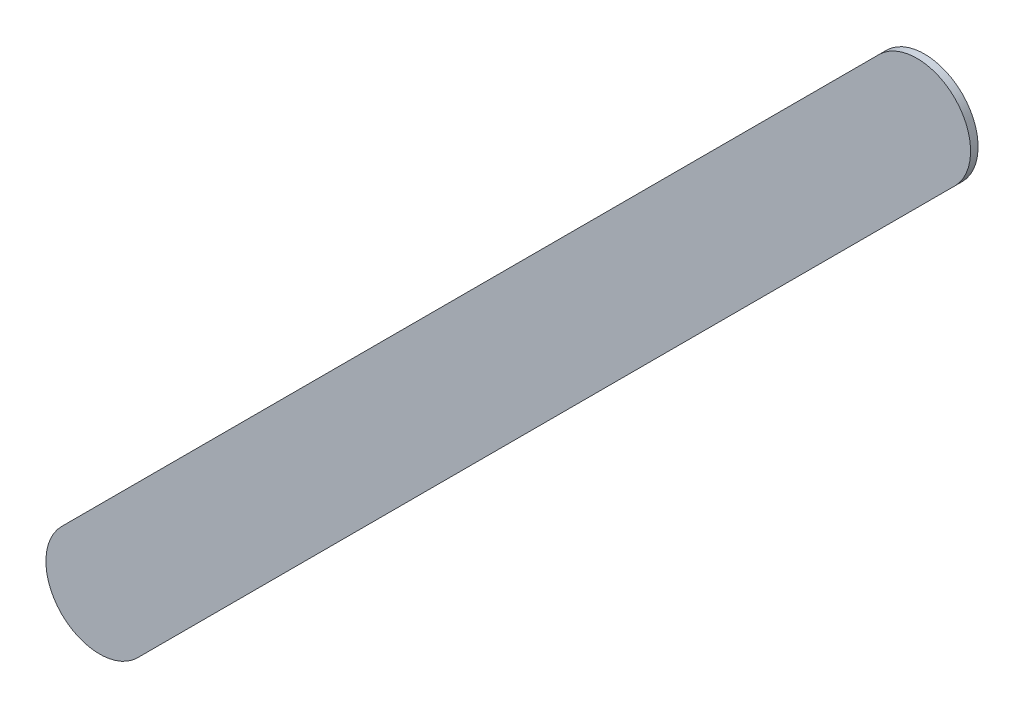
ISO-10303-21;
HEADER;
FILE_DESCRIPTION(('STEP AP214'),'2;1');
FILE_NAME('part.step','',(''),(''),'','','');
FILE_SCHEMA(('AUTOMOTIVE_DESIGN { 1 0 10303 214 1 1 1 1 }'));
ENDSEC;
DATA;
#1=APPLICATION_CONTEXT('core data for automotive mechanical design processes');
#2=APPLICATION_PROTOCOL_DEFINITION('international standard','automotive_design',2000,#1);
#3=PRODUCT_CONTEXT('',#1,'mechanical');
#4=PRODUCT('Part','Part','',(#3));
#5=PRODUCT_RELATED_PRODUCT_CATEGORY('part','',(#4));
#6=PRODUCT_DEFINITION_FORMATION('','',#4);
#7=PRODUCT_DEFINITION_CONTEXT('part definition',#1,'design');
#8=PRODUCT_DEFINITION('design','',#6,#7);
#9=PRODUCT_DEFINITION_SHAPE('','',#8);
#10=(LENGTH_UNIT() NAMED_UNIT(*) SI_UNIT(.MILLI.,.METRE.));
#11=(NAMED_UNIT(*) PLANE_ANGLE_UNIT() SI_UNIT($,.RADIAN.));
#12=(NAMED_UNIT(*) SI_UNIT($,.STERADIAN.) SOLID_ANGLE_UNIT());
#13=UNCERTAINTY_MEASURE_WITH_UNIT(LENGTH_MEASURE(1.E-05),#10,'distance_accuracy_value','');
#14=(GEOMETRIC_REPRESENTATION_CONTEXT(3) GLOBAL_UNCERTAINTY_ASSIGNED_CONTEXT((#13)) GLOBAL_UNIT_ASSIGNED_CONTEXT((#10,
#11,#12)) REPRESENTATION_CONTEXT('',''));
#15=CARTESIAN_POINT('',(0.,0.,0.));
#16=DIRECTION('',(0.,0.,1.));
#17=DIRECTION('',(1.,0.,0.));
#18=AXIS2_PLACEMENT_3D('',#15,#16,#17);
#19=CARTESIAN_POINT('',(143.686776,-110.158776,0.));
#20=DIRECTION('',(0.,0.,1.));
#21=DIRECTION('',(1.,0.,0.));
#22=AXIS2_PLACEMENT_3D('',#19,#20,#21);
#23=PLANE('',#22);
#24=DIRECTION('',(0.707106781186548,0.707106781186548,0.));
#25=VECTOR('',#24,1.);
#26=CARTESIAN_POINT('',(143.686776,-110.158776,0.));
#27=LINE('',#26,#25);
#28=CARTESIAN_POINT('',(143.686776,-110.158776,0.));
#29=VERTEX_POINT('',#28);
#30=CARTESIAN_POINT('',(147.496776,-106.348776,0.));
#31=VERTEX_POINT('',#30);
#32=EDGE_CURVE('E95',#29,#31,#27,.T.);
#33=ORIENTED_EDGE('',*,*,#32,.T.);
#34=CARTESIAN_POINT('',(147.3199995,-106.1719995,0.));
#35=DIRECTION('',(0.,0.,1.));
#36=DIRECTION('',(0.707106781186548,-0.707106781186548,0.));
#37=AXIS2_PLACEMENT_3D('',#34,#35,#36);
#38=CIRCLE('',#37,0.249999723809);
#39=CARTESIAN_POINT('',(147.143223,-105.995223,0.));
#40=VERTEX_POINT('',#39);
#41=EDGE_CURVE('E91',#31,#40,#38,.T.);
#42=ORIENTED_EDGE('',*,*,#41,.T.);
#43=DIRECTION('',(-0.707106781186548,-0.707106781186548,0.));
#44=VECTOR('',#43,1.);
#45=CARTESIAN_POINT('',(147.143223,-105.995223,0.));
#46=LINE('',#45,#44);
#47=CARTESIAN_POINT('',(143.333223,-109.805223,0.));
#48=VERTEX_POINT('',#47);
#49=EDGE_CURVE('E106',#40,#48,#46,.T.);
#50=ORIENTED_EDGE('',*,*,#49,.T.);
#51=CARTESIAN_POINT('',(143.5099995,-109.9819995,0.));
#52=DIRECTION('',(0.,0.,1.));
#53=DIRECTION('',(-0.707106781186548,0.707106781186548,0.));
#54=AXIS2_PLACEMENT_3D('',#51,#52,#53);
#55=CIRCLE('',#54,0.249999723809);
#56=EDGE_CURVE('E11',#48,#29,#55,.T.);
#57=ORIENTED_EDGE('',*,*,#56,.T.);
#58=EDGE_LOOP('',(#33,#42,#50,#57));
#59=FACE_BOUND('',#58,.T.);
#60=ADVANCED_FACE('F17',(#59),#23,.T.);
#61=CARTESIAN_POINT('',(143.686776,-110.158776,-0.035));
#62=DIRECTION('',(0.,0.,1.));
#63=DIRECTION('',(1.,0.,0.));
#64=AXIS2_PLACEMENT_3D('',#61,#62,#63);
#65=PLANE('',#64);
#66=CARTESIAN_POINT('',(143.5099995,-109.9819995,-0.035));
#67=DIRECTION('',(0.,0.,1.));
#68=DIRECTION('',(-0.707106781186548,0.707106781186548,0.));
#69=AXIS2_PLACEMENT_3D('',#66,#67,#68);
#70=CIRCLE('',#69,0.249999723809);
#71=CARTESIAN_POINT('',(143.333223,-109.805223,-0.035));
#72=VERTEX_POINT('',#71);
#73=CARTESIAN_POINT('',(143.686776,-110.158776,-0.035));
#74=VERTEX_POINT('',#73);
#75=EDGE_CURVE('E25',#72,#74,#70,.T.);
#76=ORIENTED_EDGE('',*,*,#75,.F.);
#77=DIRECTION('',(-0.707106781186548,-0.707106781186548,0.));
#78=VECTOR('',#77,1.);
#79=CARTESIAN_POINT('',(147.143223,-105.995223,-0.035));
#80=LINE('',#79,#78);
#81=CARTESIAN_POINT('',(147.143223,-105.995223,-0.035));
#82=VERTEX_POINT('',#81);
#83=EDGE_CURVE('E69',#82,#72,#80,.T.);
#84=ORIENTED_EDGE('',*,*,#83,.F.);
#85=CARTESIAN_POINT('',(147.3199995,-106.1719995,-0.035));
#86=DIRECTION('',(0.,0.,1.));
#87=DIRECTION('',(0.707106781186548,-0.707106781186548,0.));
#88=AXIS2_PLACEMENT_3D('',#85,#86,#87);
#89=CIRCLE('',#88,0.249999723809);
#90=CARTESIAN_POINT('',(147.496776,-106.348776,-0.035));
#91=VERTEX_POINT('',#90);
#92=EDGE_CURVE('E76',#91,#82,#89,.T.);
#93=ORIENTED_EDGE('',*,*,#92,.F.);
#94=DIRECTION('',(0.707106781186548,0.707106781186548,0.));
#95=VECTOR('',#94,1.);
#96=CARTESIAN_POINT('',(143.686776,-110.158776,-0.035));
#97=LINE('',#96,#95);
#98=EDGE_CURVE('E80',#74,#91,#97,.T.);
#99=ORIENTED_EDGE('',*,*,#98,.F.);
#100=EDGE_LOOP('',(#76,#84,#93,#99));
#101=FACE_BOUND('',#100,.T.);
#102=ADVANCED_FACE('F78',(#101),#65,.F.);
#103=CARTESIAN_POINT('',(143.5099995,-109.9819995,-0.035));
#104=DIRECTION('',(0.,0.,-1.));
#105=DIRECTION('',(-0.707106781186548,0.707106781186548,0.));
#106=AXIS2_PLACEMENT_3D('',#103,#104,#105);
#107=CYLINDRICAL_SURFACE('',#106,0.249999723809);
#108=ORIENTED_EDGE('',*,*,#75,.T.);
#109=DIRECTION('',(0.,0.,1.));
#110=VECTOR('',#109,1.);
#111=CARTESIAN_POINT('',(143.686776,-110.158776,-0.035));
#112=LINE('',#111,#110);
#113=EDGE_CURVE('E85',#74,#29,#112,.T.);
#114=ORIENTED_EDGE('',*,*,#113,.T.);
#115=ORIENTED_EDGE('',*,*,#56,.F.);
#116=DIRECTION('',(0.,0.,1.));
#117=VECTOR('',#116,1.);
#118=CARTESIAN_POINT('',(143.333223,-109.805223,-0.035));
#119=LINE('',#118,#117);
#120=EDGE_CURVE('E117',#72,#48,#119,.T.);
#121=ORIENTED_EDGE('',*,*,#120,.F.);
#122=EDGE_LOOP('',(#108,#114,#115,#121));
#123=FACE_BOUND('',#122,.T.);
#124=ADVANCED_FACE('F125',(#123),#107,.T.);
#125=CARTESIAN_POINT('',(147.143223,-105.995223,-0.035));
#126=DIRECTION('',(0.707106781186548,-0.707106781186548,0.));
#127=DIRECTION('',(0.,0.,-1.));
#128=AXIS2_PLACEMENT_3D('',#125,#126,#127);
#129=PLANE('',#128);
#130=ORIENTED_EDGE('',*,*,#83,.T.);
#131=ORIENTED_EDGE('',*,*,#120,.T.);
#132=ORIENTED_EDGE('',*,*,#49,.F.);
#133=DIRECTION('',(0.,0.,1.));
#134=VECTOR('',#133,1.);
#135=CARTESIAN_POINT('',(147.143223,-105.995223,-0.035));
#136=LINE('',#135,#134);
#137=EDGE_CURVE('E84',#82,#40,#136,.T.);
#138=ORIENTED_EDGE('',*,*,#137,.F.);
#139=EDGE_LOOP('',(#130,#131,#132,#138));
#140=FACE_BOUND('',#139,.T.);
#141=ADVANCED_FACE('F124',(#140),#129,.F.);
#142=CARTESIAN_POINT('',(147.3199995,-106.1719995,-0.035));
#143=DIRECTION('',(0.,0.,-1.));
#144=DIRECTION('',(0.707106781186548,-0.707106781186548,0.));
#145=AXIS2_PLACEMENT_3D('',#142,#143,#144);
#146=CYLINDRICAL_SURFACE('',#145,0.249999723809);
#147=ORIENTED_EDGE('',*,*,#92,.T.);
#148=ORIENTED_EDGE('',*,*,#137,.T.);
#149=ORIENTED_EDGE('',*,*,#41,.F.);
#150=DIRECTION('',(0.,0.,1.));
#151=VECTOR('',#150,1.);
#152=CARTESIAN_POINT('',(147.496776,-106.348776,-0.035));
#153=LINE('',#152,#151);
#154=EDGE_CURVE('E88',#91,#31,#153,.T.);
#155=ORIENTED_EDGE('',*,*,#154,.F.);
#156=EDGE_LOOP('',(#147,#148,#149,#155));
#157=FACE_BOUND('',#156,.T.);
#158=ADVANCED_FACE('F89',(#157),#146,.T.);
#159=CARTESIAN_POINT('',(143.686776,-110.158776,-0.035));
#160=DIRECTION('',(-0.707106781186548,0.707106781186548,0.));
#161=DIRECTION('',(0.,0.,1.));
#162=AXIS2_PLACEMENT_3D('',#159,#160,#161);
#163=PLANE('',#162);
#164=ORIENTED_EDGE('',*,*,#98,.T.);
#165=ORIENTED_EDGE('',*,*,#154,.T.);
#166=ORIENTED_EDGE('',*,*,#32,.F.);
#167=ORIENTED_EDGE('',*,*,#113,.F.);
#168=EDGE_LOOP('',(#164,#165,#166,#167));
#169=FACE_BOUND('',#168,.T.);
#170=ADVANCED_FACE('F97',(#169),#163,.F.);
#171=CLOSED_SHELL('',(#60,#102,#124,#141,#158,#170));
#172=MANIFOLD_SOLID_BREP('B1',#171);
#173=ADVANCED_BREP_SHAPE_REPRESENTATION('',(#18,#172),#14);
#174=SHAPE_DEFINITION_REPRESENTATION(#9,#173);
ENDSEC;
END-ISO-10303-21;
